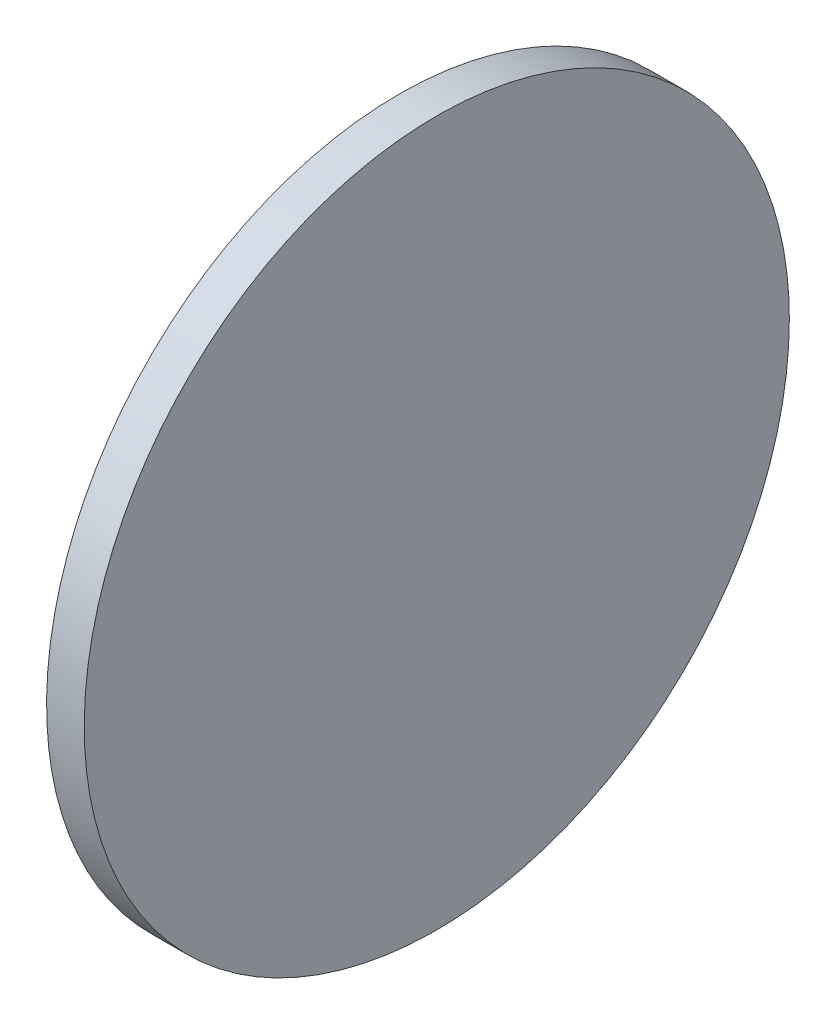
ISO-10303-21;
HEADER;
FILE_DESCRIPTION(('STEP AP214'),'2;1');
FILE_NAME('part.step','',(''),(''),'','','');
FILE_SCHEMA(('AUTOMOTIVE_DESIGN { 1 0 10303 214 1 1 1 1 }'));
ENDSEC;
DATA;
#1=APPLICATION_CONTEXT('core data for automotive mechanical design processes');
#2=APPLICATION_PROTOCOL_DEFINITION('international standard','automotive_design',2000,#1);
#3=PRODUCT_CONTEXT('',#1,'mechanical');
#4=PRODUCT('Part','Part','',(#3));
#5=PRODUCT_RELATED_PRODUCT_CATEGORY('part','',(#4));
#6=PRODUCT_DEFINITION_FORMATION('','',#4);
#7=PRODUCT_DEFINITION_CONTEXT('part definition',#1,'design');
#8=PRODUCT_DEFINITION('design','',#6,#7);
#9=PRODUCT_DEFINITION_SHAPE('','',#8);
#10=(LENGTH_UNIT() NAMED_UNIT(*) SI_UNIT(.MILLI.,.METRE.));
#11=(NAMED_UNIT(*) PLANE_ANGLE_UNIT() SI_UNIT($,.RADIAN.));
#12=(NAMED_UNIT(*) SI_UNIT($,.STERADIAN.) SOLID_ANGLE_UNIT());
#13=UNCERTAINTY_MEASURE_WITH_UNIT(LENGTH_MEASURE(1.E-05),#10,'distance_accuracy_value','');
#14=(GEOMETRIC_REPRESENTATION_CONTEXT(3) GLOBAL_UNCERTAINTY_ASSIGNED_CONTEXT((#13)) GLOBAL_UNIT_ASSIGNED_CONTEXT((#10,
#11,#12)) REPRESENTATION_CONTEXT('',''));
#15=CARTESIAN_POINT('',(0.,0.,0.));
#16=DIRECTION('',(0.,0.,1.));
#17=DIRECTION('',(1.,0.,0.));
#18=AXIS2_PLACEMENT_3D('',#15,#16,#17);
#19=CARTESIAN_POINT('',(19.6334964585086,155.701818130093,430.480952325398));
#20=CARTESIAN_POINT('',(19.6334964585086,153.851054658361,430.480952325398));
#21=CARTESIAN_POINT('',(19.6334964585086,150.149527714895,430.845520908624));
#22=CARTESIAN_POINT('',(19.6334964585086,144.810608706592,432.465064283841));
#23=CARTESIAN_POINT('',(19.6334964585086,139.890232768574,435.095060015776));
#24=CARTESIAN_POINT('',(19.6334964585086,135.57748718876,438.634438843369));
#25=CARTESIAN_POINT('',(19.6334964585086,132.038108361166,442.947184423184));
#26=CARTESIAN_POINT('',(19.6334964585086,129.408112629231,447.867560361202));
#27=CARTESIAN_POINT('',(19.6334964585086,127.788569254014,453.206479369504));
#28=CARTESIAN_POINT('',(19.6334964585086,127.241716379175,458.758769784703));
#29=CARTESIAN_POINT('',(19.6334964585086,127.788569254014,464.311060199901));
#30=CARTESIAN_POINT('',(19.6334964585086,129.408112629231,469.649979208204));
#31=CARTESIAN_POINT('',(19.6334964585086,132.038108361166,474.570355146222));
#32=CARTESIAN_POINT('',(19.6334964585086,135.57748718876,478.883100726036));
#33=CARTESIAN_POINT('',(19.6334964585086,139.890232768574,482.42247955363));
#34=CARTESIAN_POINT('',(19.6334964585086,144.810608706592,485.052475285565));
#35=CARTESIAN_POINT('',(19.6334964585086,150.149527714895,486.672018660782));
#36=CARTESIAN_POINT('',(19.6334964585086,155.701818130093,487.218871535621));
#37=CARTESIAN_POINT('',(19.6334964585086,161.254108545292,486.672018660782));
#38=CARTESIAN_POINT('',(19.6334964585086,166.593027553594,485.052475285565));
#39=CARTESIAN_POINT('',(19.6334964585086,171.513403491613,482.42247955363));
#40=CARTESIAN_POINT('',(19.6334964585086,175.826149071427,478.883100726036));
#41=CARTESIAN_POINT('',(19.6334964585086,179.36552789902,474.570355146222));
#42=CARTESIAN_POINT('',(19.6334964585086,181.995523630955,469.649979208204));
#43=CARTESIAN_POINT('',(19.6334964585086,183.615067006172,464.311060199901));
#44=CARTESIAN_POINT('',(19.6334964585086,184.161919881012,458.758769784703));
#45=CARTESIAN_POINT('',(19.6334964585086,183.615067006172,453.206479369504));
#46=CARTESIAN_POINT('',(19.6334964585086,181.995523630955,447.867560361202));
#47=CARTESIAN_POINT('',(19.6334964585086,179.36552789902,442.947184423183));
#48=CARTESIAN_POINT('',(19.6334964585086,175.826149071427,438.634438843369));
#49=CARTESIAN_POINT('',(19.6334964585086,171.513403491613,435.095060015776));
#50=CARTESIAN_POINT('',(19.6334964585086,166.593027553595,432.465064283841));
#51=CARTESIAN_POINT('',(19.6334964585086,161.254108545292,430.845520908624));
#52=CARTESIAN_POINT('',(19.6334964585086,157.552581601826,430.480952325398));
#53=CARTESIAN_POINT('',(19.6334964585086,155.701818130093,430.480952325398));
#54=B_SPLINE_CURVE_WITH_KNOTS('',3,(#19,#20,#21,#22,#23,#24,#25,#26,#27,#28,#29,#30,#31,#32,#33,
#34,#35,#36,#37,#38,#39,#40,#41,#42,#43,#44,#45,#46,#47,#48,#49,#50,#51,#52,#53),.UNSPECIFIED.,
.T.,.F.,(4,1,1,1,1,1,1,1,1,1,1,1,1,1,1,1,1,1,1,1,1,1,1,1,1,1,1,1,1,1,1,1,4),(0.,
0.0312499999999999,0.0625,0.0937500000000001,0.125,0.15625,0.1875,0.21875,0.25,0.28125,0.3125,
0.34375,0.375,0.40625,0.4375,0.46875,0.5,0.53125,0.5625,0.59375,0.625,0.65625,0.6875,0.71875,
0.75,0.78125,0.8125,0.84375,0.875,0.90625,0.9375,0.96875,1.),.UNSPECIFIED.);
#55=DIRECTION('',(1.,0.,0.));
#56=VECTOR('',#55,1.);
#57=SURFACE_OF_LINEAR_EXTRUSION('',#54,#56);
#58=CARTESIAN_POINT('',(19.6334964585086,155.701818130093,430.480952325398));
#59=CARTESIAN_POINT('',(19.6334964585086,156.164511839116,430.48095242137));
#60=CARTESIAN_POINT('',(19.6334964585086,156.627202180712,430.492345229681));
#61=CARTESIAN_POINT('',(19.6334964585086,157.551471567459,430.537806752615));
#62=CARTESIAN_POINT('',(19.6334964585086,158.013050603949,430.57187564338));
#63=CARTESIAN_POINT('',(19.6334964585086,158.933985596149,430.662579809447));
#64=CARTESIAN_POINT('',(19.6334964585086,159.39334155186,430.719215084749));
#65=CARTESIAN_POINT('',(19.6334964585086,160.30872142176,430.854943253649));
#66=CARTESIAN_POINT('',(19.6334964585086,160.764745361805,430.934035972796));
#67=CARTESIAN_POINT('',(19.6334964585086,161.67234792648,431.114569344578));
#68=CARTESIAN_POINT('',(19.6334964585086,162.123926551112,431.216009997213));
#69=CARTESIAN_POINT('',(19.6334964585086,163.021568264081,431.440914255462));
#70=CARTESIAN_POINT('',(19.6334964585086,163.467631309548,431.564378032143));
#71=CARTESIAN_POINT('',(19.6334964585086,164.353175019456,431.833004779367));
#72=CARTESIAN_POINT('',(19.6334964585086,164.792655683898,431.978167749912));
#73=CARTESIAN_POINT('',(19.6334964585086,165.663967606357,432.289869711886));
#74=CARTESIAN_POINT('',(19.6334964585086,166.095798923768,432.456408537263));
#75=CARTESIAN_POINT('',(19.6334964585086,166.95074182666,432.810537482658));
#76=CARTESIAN_POINT('',(19.6334964585086,167.373853412142,432.998127602676));
#77=CARTESIAN_POINT('',(19.6334964585086,168.210370552322,433.393831600812));
#78=CARTESIAN_POINT('',(19.6334964585086,168.623776031598,433.601945638345));
#79=CARTESIAN_POINT('',(19.6334964585086,169.439897787422,434.038171805121));
#80=CARTESIAN_POINT('',(19.6334964585086,169.842614063968,434.266283934364));
#81=CARTESIAN_POINT('',(19.6334964585086,170.636373936394,434.741981154164));
#82=CARTESIAN_POINT('',(19.6334964585086,171.02741762292,434.989566093445));
#83=CARTESIAN_POINT('',(19.6334964585086,171.79684590757,435.503681636659));
#84=CARTESIAN_POINT('',(19.6334964585086,172.175230505694,435.770212240592));
#85=CARTESIAN_POINT('',(19.6334964585086,172.918476183195,436.321509295617));
#86=CARTESIAN_POINT('',(19.6334964585086,173.283337157499,436.606275888347));
#87=CARTESIAN_POINT('',(19.6334964585086,173.998673859273,437.193337547793));
#88=CARTESIAN_POINT('',(19.6334964585086,174.349149586741,437.49563261451));
#89=CARTESIAN_POINT('',(19.6334964585086,175.034853662,438.117044314734));
#90=CARTESIAN_POINT('',(19.6334964585086,175.370082128208,438.436160817557));
#91=CARTESIAN_POINT('',(19.6334964585086,176.024427097239,439.090505786588));
#92=CARTESIAN_POINT('',(19.6334964585086,176.343543600062,439.425734252796));
#93=CARTESIAN_POINT('',(19.6334964585086,176.964955300287,440.111438328055));
#94=CARTESIAN_POINT('',(19.6334964585086,177.267250367003,440.461914055524));
#95=CARTESIAN_POINT('',(19.6334964585086,177.854312026449,441.177250757297));
#96=CARTESIAN_POINT('',(19.6334964585086,178.13907861918,441.542111731601));
#97=CARTESIAN_POINT('',(19.6334964585086,178.690375674204,442.285357409102));
#98=CARTESIAN_POINT('',(19.6334964585086,178.956906278137,442.663742007226));
#99=CARTESIAN_POINT('',(19.6334964585086,179.471021821351,443.433170291876));
#100=CARTESIAN_POINT('',(19.6334964585086,179.718606760632,443.824213978401));
#101=CARTESIAN_POINT('',(19.6334964585086,180.194303980433,444.617973850829));
#102=CARTESIAN_POINT('',(19.6334964585086,180.422416109676,445.020690127378));
#103=CARTESIAN_POINT('',(19.6334964585086,180.858642276451,445.836811883194));
#104=CARTESIAN_POINT('',(19.6334964585086,181.066756313983,446.250217362461));
#105=CARTESIAN_POINT('',(19.6334964585086,181.462460312121,447.086734502668));
#106=CARTESIAN_POINT('',(19.6334964585086,181.650050432141,447.509846088188));
#107=CARTESIAN_POINT('',(19.6334964585086,182.004179377531,448.364788990977));
#108=CARTESIAN_POINT('',(19.6334964585086,182.1707182029,448.796620308247));
#109=CARTESIAN_POINT('',(19.6334964585086,182.482420164894,449.667932231092));
#110=CARTESIAN_POINT('',(19.6334964585086,182.627583135464,450.10741289606));
#111=CARTESIAN_POINT('',(19.6334964585086,182.896209882618,450.992956604529));
#112=CARTESIAN_POINT('',(19.6334964585086,183.019673659201,451.43901964803));
#113=CARTESIAN_POINT('',(19.6334964585086,183.244577917716,452.33666136637));
#114=CARTESIAN_POINT('',(19.6334964585086,183.346018570713,452.788239998338));
#115=CARTESIAN_POINT('',(19.6334964585086,183.526551941506,453.69584254297));
#116=CARTESIAN_POINT('',(19.6334964585086,183.605644659301,454.151866455634));
#117=CARTESIAN_POINT('',(19.6334964585086,183.741372831893,455.067246400339));
#118=CARTESIAN_POINT('',(19.6334964585086,183.798008112239,455.526602458235));
#119=CARTESIAN_POINT('',(19.6334964585086,183.888712264526,456.44753717126));
#120=CARTESIAN_POINT('',(19.6334964585086,183.922781136465,456.909115826388));
#121=CARTESIAN_POINT('',(19.6334964585086,183.968242710831,457.833386255028));
#122=CARTESIAN_POINT('',(19.6334964585086,183.979635589399,458.296078019866));
#123=CARTESIAN_POINT('',(19.6334964585086,183.979635589399,459.22146154954));
#124=CARTESIAN_POINT('',(19.6334964585086,183.968242710831,459.684153314377));
#125=CARTESIAN_POINT('',(19.6334964585086,183.922781136465,460.608423743017));
#126=CARTESIAN_POINT('',(19.6334964585086,183.888712264526,461.070002398146));
#127=CARTESIAN_POINT('',(19.6334964585086,183.798008112239,461.990937111171));
#128=CARTESIAN_POINT('',(19.6334964585086,183.741372831893,462.450293169067));
#129=CARTESIAN_POINT('',(19.6334964585086,183.605644659301,463.365673113771));
#130=CARTESIAN_POINT('',(19.6334964585086,183.526551941506,463.821697026436));
#131=CARTESIAN_POINT('',(19.6334964585086,183.346018570713,464.729299571068));
#132=CARTESIAN_POINT('',(19.6334964585086,183.244577917716,465.180878203036));
#133=CARTESIAN_POINT('',(19.6334964585086,183.019673659201,466.078519921376));
#134=CARTESIAN_POINT('',(19.6334964585086,182.896209882618,466.524582964877));
#135=CARTESIAN_POINT('',(19.6334964585086,182.627583135464,467.410126673346));
#136=CARTESIAN_POINT('',(19.6334964585086,182.482420164894,467.849607338314));
#137=CARTESIAN_POINT('',(19.6334964585086,182.1707182029,468.720919261159));
#138=CARTESIAN_POINT('',(19.6334964585086,182.004179377531,469.152750578429));
#139=CARTESIAN_POINT('',(19.6334964585086,181.650050432141,470.007693481218));
#140=CARTESIAN_POINT('',(19.6334964585086,181.462460312121,470.430805066738));
#141=CARTESIAN_POINT('',(19.6334964585086,181.066756313983,471.267322206945));
#142=CARTESIAN_POINT('',(19.6334964585086,180.858642276451,471.680727686212));
#143=CARTESIAN_POINT('',(19.6334964585086,180.422416109676,472.496849442028));
#144=CARTESIAN_POINT('',(19.6334964585086,180.194303980432,472.899565718577));
#145=CARTESIAN_POINT('',(19.6334964585086,179.718606760632,473.693325591005));
#146=CARTESIAN_POINT('',(19.6334964585086,179.471021821351,474.08436927753));
#147=CARTESIAN_POINT('',(19.6334964585086,178.956906278137,474.85379756218));
#148=CARTESIAN_POINT('',(19.6334964585086,178.690375674204,475.232182160304));
#149=CARTESIAN_POINT('',(19.6334964585086,178.13907861918,475.975427837804));
#150=CARTESIAN_POINT('',(19.6334964585086,177.854312026449,476.340288812109));
#151=CARTESIAN_POINT('',(19.6334964585086,177.267250367003,477.055625513882));
#152=CARTESIAN_POINT('',(19.6334964585086,176.964955300287,477.406101241351));
#153=CARTESIAN_POINT('',(19.6334964585086,176.343543600062,478.091805316609));
#154=CARTESIAN_POINT('',(19.6334964585086,176.024427097239,478.427033782817));
#155=CARTESIAN_POINT('',(19.6334964585086,175.370082128208,479.081378751848));
#156=CARTESIAN_POINT('',(19.6334964585086,175.034853662,479.400495254671));
#157=CARTESIAN_POINT('',(19.6334964585086,174.349149586741,480.021906954896));
#158=CARTESIAN_POINT('',(19.6334964585086,173.998673859273,480.324202021612));
#159=CARTESIAN_POINT('',(19.6334964585086,173.283337157499,480.911263681059));
#160=CARTESIAN_POINT('',(19.6334964585086,172.918476183195,481.196030273789));
#161=CARTESIAN_POINT('',(19.6334964585086,172.175230505694,481.747327328814));
#162=CARTESIAN_POINT('',(19.6334964585086,171.79684590757,482.013857932747));
#163=CARTESIAN_POINT('',(19.6334964585086,171.027417622921,482.52797347596));
#164=CARTESIAN_POINT('',(19.6334964585086,170.636373936395,482.775558415241));
#165=CARTESIAN_POINT('',(19.6334964585086,169.842614063967,483.251255635042));
#166=CARTESIAN_POINT('',(19.6334964585086,169.439897787418,483.479367764285));
#167=CARTESIAN_POINT('',(19.6334964585086,168.623776031602,483.915593931061));
#168=CARTESIAN_POINT('',(19.6334964585086,168.210370552335,484.123707968593));
#169=CARTESIAN_POINT('',(19.6334964585086,167.373853412128,484.51941196673));
#170=CARTESIAN_POINT('',(19.6334964585086,166.950741826608,484.70700208675));
#171=CARTESIAN_POINT('',(19.6334964585086,166.095798923819,485.06113103214));
#172=CARTESIAN_POINT('',(19.6334964585086,165.66396760655,485.22766985751));
#173=CARTESIAN_POINT('',(19.6334964585086,164.792655683705,485.539371819504));
#174=CARTESIAN_POINT('',(19.6334964585086,164.353175018737,485.684534790074));
#175=CARTESIAN_POINT('',(19.6334964585086,163.467631310267,485.953161537227));
#176=CARTESIAN_POINT('',(19.6334964585086,163.021568266766,486.076625313811));
#177=CARTESIAN_POINT('',(19.6334964585086,162.123926548426,486.301529572325));
#178=CARTESIAN_POINT('',(19.6334964585086,161.672347916459,486.402970225323));
#179=CARTESIAN_POINT('',(19.6334964585086,160.764745371826,486.583503596115));
#180=CARTESIAN_POINT('',(19.6334964585086,160.308721459162,486.662596313911));
#181=CARTESIAN_POINT('',(19.6334964585086,159.393341514457,486.798324486503));
#182=CARTESIAN_POINT('',(19.6334964585086,158.933985456561,486.854959766849));
#183=CARTESIAN_POINT('',(19.6334964585086,158.013050743537,486.945663919135));
#184=CARTESIAN_POINT('',(19.6334964585086,157.551472088408,486.979732791075));
#185=CARTESIAN_POINT('',(19.6334964585086,156.627201659768,487.02519436544));
#186=CARTESIAN_POINT('',(19.6334964585086,156.164509894931,487.036587244008));
#187=CARTESIAN_POINT('',(19.6334964585086,155.239126365256,487.036587244008));
#188=CARTESIAN_POINT('',(19.6334964585086,154.776434600419,487.02519436544));
#189=CARTESIAN_POINT('',(19.6334964585086,153.852164171779,486.979732791075));
#190=CARTESIAN_POINT('',(19.6334964585086,153.39058551665,486.945663919135));
#191=CARTESIAN_POINT('',(19.6334964585086,152.469650803625,486.854959766849));
#192=CARTESIAN_POINT('',(19.6334964585086,152.01029474573,486.798324486503));
#193=CARTESIAN_POINT('',(19.6334964585086,151.094914801025,486.662596313911));
#194=CARTESIAN_POINT('',(19.6334964585086,150.63889088836,486.583503596115));
#195=CARTESIAN_POINT('',(19.6334964585086,149.731288343728,486.402970225323));
#196=CARTESIAN_POINT('',(19.6334964585086,149.279709711761,486.301529572326));
#197=CARTESIAN_POINT('',(19.6334964585086,148.382067993421,486.076625313811));
#198=CARTESIAN_POINT('',(19.6334964585086,147.936004949919,485.953161537227));
#199=CARTESIAN_POINT('',(19.6334964585086,147.05046124145,485.684534790074));
#200=CARTESIAN_POINT('',(19.6334964585086,146.610980576482,485.539371819504));
#201=CARTESIAN_POINT('',(19.6334964585086,145.739668653637,485.22766985751));
#202=CARTESIAN_POINT('',(19.6334964585086,145.307837336368,485.06113103214));
#203=CARTESIAN_POINT('',(19.6334964585086,144.452894433578,484.70700208675));
#204=CARTESIAN_POINT('',(19.6334964585086,144.029782848059,484.51941196673));
#205=CARTESIAN_POINT('',(19.6334964585086,143.193265707851,484.123707968593));
#206=CARTESIAN_POINT('',(19.6334964585086,142.779860228585,483.915593931061));
#207=CARTESIAN_POINT('',(19.6334964585086,141.963738472769,483.479367764285));
#208=CARTESIAN_POINT('',(19.6334964585086,141.561022196219,483.251255635042));
#209=CARTESIAN_POINT('',(19.6334964585086,140.767262323792,482.775558415241));
#210=CARTESIAN_POINT('',(19.6334964585086,140.376218637266,482.52797347596));
#211=CARTESIAN_POINT('',(19.6334964585086,139.606790352617,482.013857932747));
#212=CARTESIAN_POINT('',(19.6334964585086,139.228405754493,481.747327328814));
#213=CARTESIAN_POINT('',(19.6334964585086,138.485160076992,481.196030273789));
#214=CARTESIAN_POINT('',(19.6334964585086,138.120299102687,480.911263681059));
#215=CARTESIAN_POINT('',(19.6334964585086,137.404962400914,480.324202021612));
#216=CARTESIAN_POINT('',(19.6334964585086,137.054486673446,480.021906954896));
#217=CARTESIAN_POINT('',(19.6334964585086,136.368782598187,479.400495254671));
#218=CARTESIAN_POINT('',(19.6334964585086,136.033554131979,479.081378751848));
#219=CARTESIAN_POINT('',(19.6334964585086,135.379209162948,478.427033782817));
#220=CARTESIAN_POINT('',(19.6334964585086,135.060092660125,478.091805316609));
#221=CARTESIAN_POINT('',(19.6334964585086,134.4386809599,477.40610124135));
#222=CARTESIAN_POINT('',(19.6334964585086,134.136385893184,477.055625513882));
#223=CARTESIAN_POINT('',(19.6334964585086,133.549324233737,476.340288812109));
#224=CARTESIAN_POINT('',(19.6334964585086,133.264557641007,475.975427837804));
#225=CARTESIAN_POINT('',(19.6334964585086,132.713260585982,475.232182160304));
#226=CARTESIAN_POINT('',(19.6334964585086,132.44672998205,474.85379756218));
#227=CARTESIAN_POINT('',(19.6334964585086,131.932614438836,474.08436927753));
#228=CARTESIAN_POINT('',(19.6334964585086,131.685029499555,473.693325591005));
#229=CARTESIAN_POINT('',(19.6334964585086,131.209332279754,472.899565718577));
#230=CARTESIAN_POINT('',(19.6334964585086,130.981220150511,472.496849442027));
#231=CARTESIAN_POINT('',(19.6334964585086,130.544993983736,471.680727686212));
#232=CARTESIAN_POINT('',(19.6334964585086,130.336879946204,471.267322206945));
#233=CARTESIAN_POINT('',(19.6334964585086,129.941175948066,470.430805066737));
#234=CARTESIAN_POINT('',(19.6334964585086,129.753585828046,470.007693481218));
#235=CARTESIAN_POINT('',(19.6334964585086,129.399456882656,469.152750578429));
#236=CARTESIAN_POINT('',(19.6334964585086,129.232918057286,468.720919261159));
#237=CARTESIAN_POINT('',(19.6334964585086,128.921216095293,467.849607338314));
#238=CARTESIAN_POINT('',(19.6334964585086,128.776053124722,467.410126673346));
#239=CARTESIAN_POINT('',(19.6334964585086,128.507426377569,466.524582964877));
#240=CARTESIAN_POINT('',(19.6334964585086,128.383962600986,466.078519921376));
#241=CARTESIAN_POINT('',(19.6334964585086,128.159058342471,465.180878203036));
#242=CARTESIAN_POINT('',(19.6334964585086,128.057617689474,464.729299571068));
#243=CARTESIAN_POINT('',(19.6334964585086,127.877084318681,463.821697026436));
#244=CARTESIAN_POINT('',(19.6334964585086,127.797991600886,463.365673113771));
#245=CARTESIAN_POINT('',(19.6334964585086,127.662263428294,462.450293169067));
#246=CARTESIAN_POINT('',(19.6334964585086,127.605628147947,461.990937111171));
#247=CARTESIAN_POINT('',(19.6334964585086,127.514923995661,461.070002398146));
#248=CARTESIAN_POINT('',(19.6334964585086,127.480855123721,460.608423743017));
#249=CARTESIAN_POINT('',(19.6334964585086,127.435393549356,459.684153314377));
#250=CARTESIAN_POINT('',(19.6334964585086,127.424000670788,459.22146154954));
#251=CARTESIAN_POINT('',(19.6334964585086,127.424000670788,458.296078019866));
#252=CARTESIAN_POINT('',(19.6334964585086,127.435393549356,457.833386255028));
#253=CARTESIAN_POINT('',(19.6334964585086,127.480855123721,456.909115826388));
#254=CARTESIAN_POINT('',(19.6334964585086,127.514923995661,456.44753717126));
#255=CARTESIAN_POINT('',(19.6334964585086,127.605628147947,455.526602458235));
#256=CARTESIAN_POINT('',(19.6334964585086,127.662263428294,455.067246400339));
#257=CARTESIAN_POINT('',(19.6334964585086,127.797991600886,454.151866455634));
#258=CARTESIAN_POINT('',(19.6334964585086,127.877084318681,453.69584254297));
#259=CARTESIAN_POINT('',(19.6334964585086,128.057617689474,452.788239998338));
#260=CARTESIAN_POINT('',(19.6334964585086,128.159058342471,452.33666136637));
#261=CARTESIAN_POINT('',(19.6334964585086,128.383962600986,451.43901964803));
#262=CARTESIAN_POINT('',(19.6334964585086,128.507426377569,450.992956604529));
#263=CARTESIAN_POINT('',(19.6334964585086,128.776053124722,450.10741289606));
#264=CARTESIAN_POINT('',(19.6334964585086,128.921216095293,449.667932231091));
#265=CARTESIAN_POINT('',(19.6334964585086,129.232918057286,448.796620308247));
#266=CARTESIAN_POINT('',(19.6334964585086,129.399456882656,448.364788990977));
#267=CARTESIAN_POINT('',(19.6334964585086,129.753585828046,447.509846088188));
#268=CARTESIAN_POINT('',(19.6334964585086,129.941175948066,447.086734502668));
#269=CARTESIAN_POINT('',(19.6334964585086,130.336879946204,446.250217362461));
#270=CARTESIAN_POINT('',(19.6334964585086,130.544993983736,445.836811883194));
#271=CARTESIAN_POINT('',(19.6334964585086,130.981220150511,445.020690127378));
#272=CARTESIAN_POINT('',(19.6334964585086,131.209332279754,444.617973850829));
#273=CARTESIAN_POINT('',(19.6334964585086,131.685029499555,443.824213978401));
#274=CARTESIAN_POINT('',(19.6334964585086,131.932614438836,443.433170291876));
#275=CARTESIAN_POINT('',(19.6334964585086,132.44672998205,442.663742007226));
#276=CARTESIAN_POINT('',(19.6334964585086,132.713260585982,442.285357409102));
#277=CARTESIAN_POINT('',(19.6334964585086,133.264557641007,441.542111731601));
#278=CARTESIAN_POINT('',(19.6334964585086,133.549324233737,441.177250757297));
#279=CARTESIAN_POINT('',(19.6334964585086,134.136385893184,440.461914055524));
#280=CARTESIAN_POINT('',(19.6334964585086,134.4386809599,440.111438328055));
#281=CARTESIAN_POINT('',(19.6334964585086,135.060092660125,439.425734252796));
#282=CARTESIAN_POINT('',(19.6334964585086,135.379209162948,439.090505786588));
#283=CARTESIAN_POINT('',(19.6334964585086,136.033554131979,438.436160817557));
#284=CARTESIAN_POINT('',(19.6334964585086,136.368782598187,438.117044314734));
#285=CARTESIAN_POINT('',(19.6334964585086,137.054486673446,437.49563261451));
#286=CARTESIAN_POINT('',(19.6334964585086,137.404962400914,437.193337547793));
#287=CARTESIAN_POINT('',(19.6334964585086,138.120299102687,436.606275888347));
#288=CARTESIAN_POINT('',(19.6334964585086,138.485160076992,436.321509295617));
#289=CARTESIAN_POINT('',(19.6334964585086,139.228405754493,435.770212240592));
#290=CARTESIAN_POINT('',(19.6334964585086,139.606790352616,435.503681636659));
#291=CARTESIAN_POINT('',(19.6334964585086,140.376218637266,434.989566093445));
#292=CARTESIAN_POINT('',(19.6334964585086,140.767262323793,434.741981154164));
#293=CARTESIAN_POINT('',(19.6334964585086,141.561022196218,434.266283934364));
#294=CARTESIAN_POINT('',(19.6334964585086,141.963738472765,434.038171805121));
#295=CARTESIAN_POINT('',(19.6334964585086,142.779860228588,433.601945638345));
#296=CARTESIAN_POINT('',(19.6334964585086,143.193265707865,433.393831600812));
#297=CARTESIAN_POINT('',(19.6334964585086,144.029782848045,432.998127602676));
#298=CARTESIAN_POINT('',(19.6334964585086,144.452894433527,432.810537482658));
#299=CARTESIAN_POINT('',(19.6334964585086,145.307837336419,432.456408537263));
#300=CARTESIAN_POINT('',(19.6334964585086,145.73966865383,432.289869711886));
#301=CARTESIAN_POINT('',(19.6334964585086,146.610980576289,431.978167749912));
#302=CARTESIAN_POINT('',(19.6334964585086,147.050461240731,431.833004779367));
#303=CARTESIAN_POINT('',(19.6334964585086,147.936004950639,431.564378032143));
#304=CARTESIAN_POINT('',(19.6334964585086,148.382067996106,431.440914255463));
#305=CARTESIAN_POINT('',(19.6334964585086,149.279709709075,431.216009997213));
#306=CARTESIAN_POINT('',(19.6334964585086,149.731288333706,431.114569344578));
#307=CARTESIAN_POINT('',(19.6334964585086,150.638890898382,430.934035972796));
#308=CARTESIAN_POINT('',(19.6334964585086,151.094914838427,430.854943253649));
#309=CARTESIAN_POINT('',(19.6334964585086,152.010294708327,430.719215084749));
#310=CARTESIAN_POINT('',(19.6334964585086,152.469650664038,430.662579809447));
#311=CARTESIAN_POINT('',(19.6334964585086,153.390585656238,430.57187564338));
#312=CARTESIAN_POINT('',(19.6334964585086,153.852164692728,430.537806752615));
#313=CARTESIAN_POINT('',(19.6334964585086,154.776434079474,430.492345229681));
#314=CARTESIAN_POINT('',(19.6334964585086,155.239124421071,430.48095242137));
#315=CARTESIAN_POINT('',(19.6334964585086,155.701818130093,430.480952325398));
#316=B_SPLINE_CURVE_WITH_KNOTS('',3,(#58,#59,#60,#61,#62,#63,#64,#65,#66,#67,#68,#69,#70,#71,
#72,#73,#74,#75,#76,#77,#78,#79,#80,#81,#82,#83,#84,#85,#86,#87,#88,#89,#90,#91,#92,#93,#94,#95,
#96,#97,#98,#99,#100,#101,#102,#103,#104,#105,#106,#107,#108,#109,#110,#111,#112,#113,#114,#115,
#116,#117,#118,#119,#120,#121,#122,#123,#124,#125,#126,#127,#128,#129,#130,#131,#132,#133,#134,
#135,#136,#137,#138,#139,#140,#141,#142,#143,#144,#145,#146,#147,#148,#149,#150,#151,#152,#153,
#154,#155,#156,#157,#158,#159,#160,#161,#162,#163,#164,#165,#166,#167,#168,#169,#170,#171,#172,
#173,#174,#175,#176,#177,#178,#179,#180,#181,#182,#183,#184,#185,#186,#187,#188,#189,#190,#191,
#192,#193,#194,#195,#196,#197,#198,#199,#200,#201,#202,#203,#204,#205,#206,#207,#208,#209,#210,
#211,#212,#213,#214,#215,#216,#217,#218,#219,#220,#221,#222,#223,#224,#225,#226,#227,#228,#229,
#230,#231,#232,#233,#234,#235,#236,#237,#238,#239,#240,#241,#242,#243,#244,#245,#246,#247,#248,
#249,#250,#251,#252,#253,#254,#255,#256,#257,#258,#259,#260,#261,#262,#263,#264,#265,#266,#267,
#268,#269,#270,#271,#272,#273,#274,#275,#276,#277,#278,#279,#280,#281,#282,#283,#284,#285,#286,
#287,#288,#289,#290,#291,#292,#293,#294,#295,#296,#297,#298,#299,#300,#301,#302,#303,#304,#305,
#306,#307,#308,#309,#310,#311,#312,#313,#314,#315),.UNSPECIFIED.,.F.,.F.,(4,2,2,2,2,2,2,2,2,2,2,
2,2,2,2,2,2,2,2,2,2,2,2,2,2,2,2,2,2,2,2,2,2,2,2,2,2,2,2,2,2,2,2,2,2,2,2,2,2,2,2,2,2,2,2,2,2,2,2,
2,2,2,2,2,2,2,2,2,2,2,2,2,2,2,2,2,2,2,2,2,2,2,2,2,2,2,2,2,2,2,2,2,2,2,2,2,2,2,2,2,2,2,2,2,2,2,2,
2,2,2,2,2,2,2,2,2,2,2,2,2,2,2,2,2,2,2,2,2,4),(0.,1.38793649082465,2.77588376298442,
4.16383103514412,5.55176752596877,6.93970401679342,8.32765128895317,9.71559856111294,
11.1035350519376,12.4914715427622,13.8794188149219,15.2673660870817,16.6553025779063,
18.0432390687309,19.4311863408907,20.8191336130504,22.207070103875,23.5950065946996,
24.9829538668593,26.3709011390191,27.7588376298437,29.1467741206684,30.5347213928282,
31.9226686649879,33.3106051558126,34.6985416466372,36.086488918797,37.4744361909567,
38.8623726817813,40.2503091726059,41.6382564447656,43.0262037169253,44.4141402077499,
45.8020766985746,47.1900239707344,48.5779712428942,49.9659077337188,51.3538442245435,
52.7417914967032,54.129738768863,55.5176752596876,56.9056117505122,58.293559022672,
59.6815062948316,61.0694427856562,62.4573792764809,63.8453265486407,65.2332738208004,
66.621210311625,68.0091468024496,69.3970940746094,70.7850413467692,72.1729778375937,
73.5609143284184,74.9488616005781,76.3368088727379,77.7247453635625,79.1126818543871,
80.5006291265469,81.8885763987066,83.2765128895312,84.6644493803559,86.0523966525156,
87.4403439246753,88.8282804155,90.2162169063246,91.6041641784844,92.9921114506441,
94.3800479414687,95.7679844322934,97.1559317044531,98.5438789766128,99.9318154674375,
101.319751958262,102.707699230422,104.095646502582,105.483582993406,106.871519484231,
108.259466756391,109.64741402855,111.035350519375,112.4232870102,113.811234282359,
115.199181554519,116.587118045344,117.975054536168,119.363001808328,120.750949080488,
122.138885571313,123.526822062137,124.914769334297,126.302716606457,127.690653097281,
129.078589588106,130.466536860265,131.854484132425,133.24242062325,134.630357114075,
136.018304386234,137.406251658394,138.794188149219,140.182124640043,141.570071912203,
142.958019184363,144.345955675188,145.733892166012,147.121839438172,148.509786710332,
149.897723201156,151.285659691981,152.673606964141,154.0615542363,155.449490727125,
156.83742721795,158.225374490109,159.613321762269,161.001258253094,162.389194743918,
163.777142016078,165.165089288238,166.553025779062,167.940962269887,169.328909542047,
170.716856814207,172.104793305031,173.492729795856,174.880677068016,176.268624340175,
177.656560831),.UNSPECIFIED.);
#317=CARTESIAN_POINT('',(19.6334964585086,155.701818130093,430.480952325398));
#318=VERTEX_POINT('',#317);
#319=EDGE_CURVE('E9',#318,#318,#316,.F.);
#320=ORIENTED_EDGE('',*,*,#319,.F.);
#321=EDGE_LOOP('',(#320));
#322=FACE_BOUND('',#321,.T.);
#323=CARTESIAN_POINT('',(22.6550886607535,155.701818130093,430.480952325398));
#324=CARTESIAN_POINT('',(22.6550886607535,153.851054658361,430.480952325398));
#325=CARTESIAN_POINT('',(22.6550886607535,150.149527714895,430.845520908624));
#326=CARTESIAN_POINT('',(22.6550886607535,144.810608706592,432.465064283841));
#327=CARTESIAN_POINT('',(22.6550886607535,139.890232768574,435.095060015776));
#328=CARTESIAN_POINT('',(22.6550886607535,135.57748718876,438.634438843369));
#329=CARTESIAN_POINT('',(22.6550886607535,132.038108361166,442.947184423184));
#330=CARTESIAN_POINT('',(22.6550886607535,129.408112629231,447.867560361202));
#331=CARTESIAN_POINT('',(22.6550886607535,127.788569254014,453.206479369504));
#332=CARTESIAN_POINT('',(22.6550886607535,127.241716379175,458.758769784703));
#333=CARTESIAN_POINT('',(22.6550886607535,127.788569254014,464.311060199901));
#334=CARTESIAN_POINT('',(22.6550886607535,129.408112629231,469.649979208204));
#335=CARTESIAN_POINT('',(22.6550886607535,132.038108361166,474.570355146222));
#336=CARTESIAN_POINT('',(22.6550886607535,135.57748718876,478.883100726036));
#337=CARTESIAN_POINT('',(22.6550886607535,139.890232768574,482.42247955363));
#338=CARTESIAN_POINT('',(22.6550886607535,144.810608706592,485.052475285565));
#339=CARTESIAN_POINT('',(22.6550886607535,150.149527714895,486.672018660782));
#340=CARTESIAN_POINT('',(22.6550886607535,155.701818130093,487.218871535621));
#341=CARTESIAN_POINT('',(22.6550886607535,161.254108545292,486.672018660782));
#342=CARTESIAN_POINT('',(22.6550886607535,166.593027553594,485.052475285565));
#343=CARTESIAN_POINT('',(22.6550886607535,171.513403491613,482.42247955363));
#344=CARTESIAN_POINT('',(22.6550886607535,175.826149071427,478.883100726036));
#345=CARTESIAN_POINT('',(22.6550886607535,179.36552789902,474.570355146222));
#346=CARTESIAN_POINT('',(22.6550886607535,181.995523630955,469.649979208204));
#347=CARTESIAN_POINT('',(22.6550886607535,183.615067006172,464.311060199901));
#348=CARTESIAN_POINT('',(22.6550886607535,184.161919881012,458.758769784703));
#349=CARTESIAN_POINT('',(22.6550886607535,183.615067006172,453.206479369504));
#350=CARTESIAN_POINT('',(22.6550886607535,181.995523630955,447.867560361202));
#351=CARTESIAN_POINT('',(22.6550886607535,179.36552789902,442.947184423183));
#352=CARTESIAN_POINT('',(22.6550886607535,175.826149071427,438.634438843369));
#353=CARTESIAN_POINT('',(22.6550886607535,171.513403491613,435.095060015776));
#354=CARTESIAN_POINT('',(22.6550886607535,166.593027553595,432.465064283841));
#355=CARTESIAN_POINT('',(22.6550886607535,161.254108545292,430.845520908624));
#356=CARTESIAN_POINT('',(22.6550886607535,157.552581601826,430.480952325398));
#357=CARTESIAN_POINT('',(22.6550886607535,155.701818130093,430.480952325398));
#358=B_SPLINE_CURVE_WITH_KNOTS('',3,(#323,#324,#325,#326,#327,#328,#329,#330,#331,#332,#333,
#334,#335,#336,#337,#338,#339,#340,#341,#342,#343,#344,#345,#346,#347,#348,#349,#350,#351,#352,
#353,#354,#355,#356,#357),.UNSPECIFIED.,.T.,.F.,(4,1,1,1,1,1,1,1,1,1,1,1,1,1,1,1,1,1,1,1,1,1,1,
1,1,1,1,1,1,1,1,1,4),(0.,0.0312499999999999,0.0625,0.0937500000000001,0.125,0.15625,0.1875,
0.21875,0.25,0.28125,0.3125,0.34375,0.375,0.40625,0.4375,0.46875,0.5,0.53125,0.5625,0.59375,
0.625,0.65625,0.6875,0.71875,0.75,0.78125,0.8125,0.84375,0.875,0.90625,0.9375,0.96875,1.),.UNSPECIFIED.);
#359=CARTESIAN_POINT('',(22.6550886607535,155.701818130093,430.480952325398));
#360=VERTEX_POINT('',#359);
#361=EDGE_CURVE('E24',#360,#360,#358,.T.);
#362=ORIENTED_EDGE('',*,*,#361,.T.);
#363=EDGE_LOOP('',(#362));
#364=FACE_BOUND('',#363,.T.);
#365=ADVANCED_FACE('F14',(#322,#364),#57,.F.);
#366=CARTESIAN_POINT('',(19.6334964585086,133.760834388343,475.337166343002));
#367=DIRECTION('',(1.,0.,0.));
#368=DIRECTION('',(0.,1.,0.));
#369=AXIS2_PLACEMENT_3D('',#366,#367,#368);
#370=PLANE('',#369);
#371=ORIENTED_EDGE('',*,*,#319,.T.);
#372=EDGE_LOOP('',(#371));
#373=FACE_BOUND('',#372,.T.);
#374=ADVANCED_FACE('F59',(#373),#370,.F.);
#375=CARTESIAN_POINT('',(22.6550886607535,133.760834388343,475.337166343002));
#376=DIRECTION('',(1.,0.,0.));
#377=DIRECTION('',(0.,1.,0.));
#378=AXIS2_PLACEMENT_3D('',#375,#376,#377);
#379=PLANE('',#378);
#380=ORIENTED_EDGE('',*,*,#361,.F.);
#381=EDGE_LOOP('',(#380));
#382=FACE_BOUND('',#381,.T.);
#383=ADVANCED_FACE('F67',(#382),#379,.T.);
#384=CLOSED_SHELL('',(#365,#374,#383));
#385=MANIFOLD_SOLID_BREP('B1',#384);
#386=ADVANCED_BREP_SHAPE_REPRESENTATION('',(#18,#385),#14);
#387=SHAPE_DEFINITION_REPRESENTATION(#9,#386);
ENDSEC;
END-ISO-10303-21;
